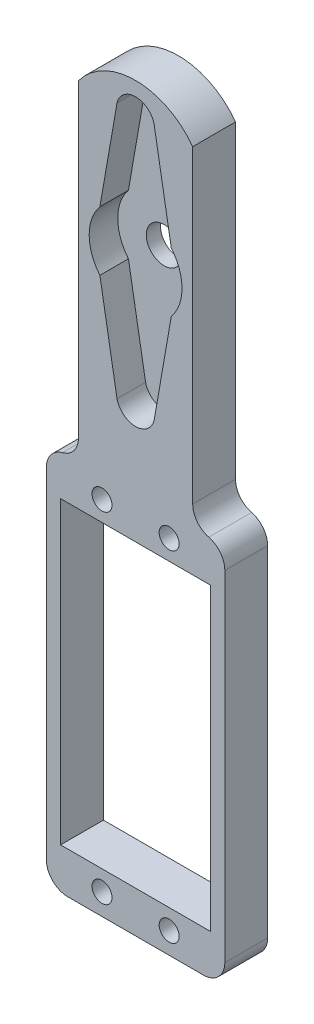
ISO-10303-21;
HEADER;
FILE_DESCRIPTION(('STEP AP214'),'2;1');
FILE_NAME('part.step','',(''),(''),'','','');
FILE_SCHEMA(('AUTOMOTIVE_DESIGN { 1 0 10303 214 1 1 1 1 }'));
ENDSEC;
DATA;
#1=APPLICATION_CONTEXT('core data for automotive mechanical design processes');
#2=APPLICATION_PROTOCOL_DEFINITION('international standard','automotive_design',2000,#1);
#3=PRODUCT_CONTEXT('',#1,'mechanical');
#4=PRODUCT('Part','Part','',(#3));
#5=PRODUCT_RELATED_PRODUCT_CATEGORY('part','',(#4));
#6=PRODUCT_DEFINITION_FORMATION('','',#4);
#7=PRODUCT_DEFINITION_CONTEXT('part definition',#1,'design');
#8=PRODUCT_DEFINITION('design','',#6,#7);
#9=PRODUCT_DEFINITION_SHAPE('','',#8);
#10=(LENGTH_UNIT() NAMED_UNIT(*) SI_UNIT(.MILLI.,.METRE.));
#11=(NAMED_UNIT(*) PLANE_ANGLE_UNIT() SI_UNIT($,.RADIAN.));
#12=(NAMED_UNIT(*) SI_UNIT($,.STERADIAN.) SOLID_ANGLE_UNIT());
#13=UNCERTAINTY_MEASURE_WITH_UNIT(LENGTH_MEASURE(1.E-05),#10,'distance_accuracy_value','');
#14=(GEOMETRIC_REPRESENTATION_CONTEXT(3) GLOBAL_UNCERTAINTY_ASSIGNED_CONTEXT((#13)) GLOBAL_UNIT_ASSIGNED_CONTEXT((#10,
#11,#12)) REPRESENTATION_CONTEXT('',''));
#15=CARTESIAN_POINT('',(0.,0.,0.));
#16=DIRECTION('',(0.,0.,1.));
#17=DIRECTION('',(1.,0.,0.));
#18=AXIS2_PLACEMENT_3D('',#15,#16,#17);
#19=CARTESIAN_POINT('',(0.,17.3284045022662,6.));
#20=DIRECTION('',(0.,0.,-1.));
#21=DIRECTION('',(-1.,0.,0.));
#22=AXIS2_PLACEMENT_3D('',#19,#20,#21);
#23=CYLINDRICAL_SURFACE('',#22,2.67159549773375);
#24=CARTESIAN_POINT('',(0.,17.3284045022662,2.));
#25=DIRECTION('',(0.,0.,-1.));
#26=DIRECTION('',(-1.,0.,0.));
#27=AXIS2_PLACEMENT_3D('',#24,#25,#26);
#28=CIRCLE('',#27,2.67159549773375);
#29=CARTESIAN_POINT('',(2.6,17.9427517196533,2.));
#30=VERTEX_POINT('',#29);
#31=CARTESIAN_POINT('',(-2.6,17.9427517196533,2.));
#32=VERTEX_POINT('',#31);
#33=EDGE_CURVE('E54',#30,#32,#28,.F.);
#34=ORIENTED_EDGE('',*,*,#33,.F.);
#35=DIRECTION('',(0.,0.,-1.));
#36=VECTOR('',#35,1.);
#37=CARTESIAN_POINT('',(2.6,17.9427517196533,6.));
#38=LINE('',#37,#36);
#39=CARTESIAN_POINT('',(2.6,17.9427517196533,6.));
#40=VERTEX_POINT('',#39);
#41=EDGE_CURVE('E340',#40,#30,#38,.T.);
#42=ORIENTED_EDGE('',*,*,#41,.F.);
#43=CARTESIAN_POINT('',(0.,17.3284045022662,6.));
#44=DIRECTION('',(0.,0.,1.));
#45=DIRECTION('',(1.,0.,0.));
#46=AXIS2_PLACEMENT_3D('',#43,#44,#45);
#47=CIRCLE('',#46,2.67159549773375);
#48=CARTESIAN_POINT('',(-2.6,17.9427517196533,6.));
#49=VERTEX_POINT('',#48);
#50=EDGE_CURVE('E233',#49,#40,#47,.F.);
#51=ORIENTED_EDGE('',*,*,#50,.F.);
#52=DIRECTION('',(0.,0.,-1.));
#53=VECTOR('',#52,1.);
#54=CARTESIAN_POINT('',(-2.6,17.9427517196533,6.));
#55=LINE('',#54,#53);
#56=EDGE_CURVE('E211',#49,#32,#55,.T.);
#57=ORIENTED_EDGE('',*,*,#56,.T.);
#58=EDGE_LOOP('',(#34,#42,#51,#57));
#59=FACE_BOUND('',#58,.T.);
#60=ADVANCED_FACE('F39',(#59),#23,.F.);
#61=CARTESIAN_POINT('',(5.55395819963136,0.96641337059102,6.));
#62=DIRECTION('',(0.985196551403809,0.171428571428571,0.));
#63=DIRECTION('',(-0.171428571428571,0.98519655140381,0.));
#64=AXIS2_PLACEMENT_3D('',#61,#62,#63);
#65=PLANE('',#64);
#66=DIRECTION('',(-0.171428571428571,0.98519655140381,0.));
#67=VECTOR('',#66,1.);
#68=CARTESIAN_POINT('',(5.55395819963136,0.96641337059102,2.));
#69=LINE('',#68,#67);
#70=CARTESIAN_POINT('',(4.99927103536296,4.15418934510465,2.));
#71=VERTEX_POINT('',#70);
#72=EDGE_CURVE('E61',#71,#30,#69,.T.);
#73=ORIENTED_EDGE('',*,*,#72,.F.);
#74=DIRECTION('',(0.,0.,-1.));
#75=VECTOR('',#74,1.);
#76=CARTESIAN_POINT('',(4.99927103536296,4.15418934510465,6.));
#77=LINE('',#76,#75);
#78=CARTESIAN_POINT('',(4.99927103536296,4.15418934510465,6.));
#79=VERTEX_POINT('',#78);
#80=EDGE_CURVE('E353',#79,#71,#77,.T.);
#81=ORIENTED_EDGE('',*,*,#80,.F.);
#82=DIRECTION('',(0.171428571428571,-0.98519655140381,0.));
#83=VECTOR('',#82,1.);
#84=CARTESIAN_POINT('',(5.55395819963136,0.96641337059102,6.));
#85=LINE('',#84,#83);
#86=EDGE_CURVE('E236',#40,#79,#85,.T.);
#87=ORIENTED_EDGE('',*,*,#86,.F.);
#88=ORIENTED_EDGE('',*,*,#41,.T.);
#89=EDGE_LOOP('',(#73,#81,#87,#88));
#90=FACE_BOUND('',#89,.T.);
#91=ADVANCED_FACE('F475',(#90),#65,.F.);
#92=CARTESIAN_POINT('',(0.,0.,6.));
#93=DIRECTION('',(0.,0.,-1.));
#94=DIRECTION('',(-1.,0.,0.));
#95=AXIS2_PLACEMENT_3D('',#92,#93,#94);
#96=CYLINDRICAL_SURFACE('',#95,6.5);
#97=ORIENTED_EDGE('',*,*,#80,.T.);
#98=CARTESIAN_POINT('',(0.,0.,2.));
#99=DIRECTION('',(0.,0.,-1.));
#100=DIRECTION('',(-1.,0.,0.));
#101=AXIS2_PLACEMENT_3D('',#98,#99,#100);
#102=CIRCLE('',#101,6.5);
#103=CARTESIAN_POINT('',(4.99927103536296,-4.15418934510465,2.));
#104=VERTEX_POINT('',#103);
#105=EDGE_CURVE('E229',#71,#104,#102,.T.);
#106=ORIENTED_EDGE('',*,*,#105,.T.);
#107=DIRECTION('',(0.,0.,-1.));
#108=VECTOR('',#107,1.);
#109=CARTESIAN_POINT('',(4.99927103536296,-4.15418934510465,6.));
#110=LINE('',#109,#108);
#111=CARTESIAN_POINT('',(4.99927103536296,-4.15418934510465,6.));
#112=VERTEX_POINT('',#111);
#113=EDGE_CURVE('E350',#112,#104,#110,.T.);
#114=ORIENTED_EDGE('',*,*,#113,.F.);
#115=CARTESIAN_POINT('',(0.,0.,6.));
#116=DIRECTION('',(0.,0.,1.));
#117=DIRECTION('',(1.,0.,0.));
#118=AXIS2_PLACEMENT_3D('',#115,#116,#117);
#119=CIRCLE('',#118,6.5);
#120=EDGE_CURVE('E239',#112,#79,#119,.T.);
#121=ORIENTED_EDGE('',*,*,#120,.T.);
#122=EDGE_LOOP('',(#97,#106,#114,#121));
#123=FACE_BOUND('',#122,.T.);
#124=ADVANCED_FACE('F480',(#123),#96,.F.);
#125=CARTESIAN_POINT('',(5.55395819963136,-0.96641337059102,6.));
#126=DIRECTION('',(-0.985196551403809,0.171428571428571,0.));
#127=DIRECTION('',(-0.171428571428571,-0.98519655140381,0.));
#128=AXIS2_PLACEMENT_3D('',#125,#126,#127);
#129=PLANE('',#128);
#130=ORIENTED_EDGE('',*,*,#113,.T.);
#131=DIRECTION('',(-0.171428571428571,-0.98519655140381,0.));
#132=VECTOR('',#131,1.);
#133=CARTESIAN_POINT('',(5.55395819963136,-0.96641337059102,2.));
#134=LINE('',#133,#132);
#135=CARTESIAN_POINT('',(2.6,-17.9427517196533,2.));
#136=VERTEX_POINT('',#135);
#137=EDGE_CURVE('E753',#104,#136,#134,.T.);
#138=ORIENTED_EDGE('',*,*,#137,.T.);
#139=DIRECTION('',(0.,0.,-1.));
#140=VECTOR('',#139,1.);
#141=CARTESIAN_POINT('',(2.6,-17.9427517196533,6.));
#142=LINE('',#141,#140);
#143=CARTESIAN_POINT('',(2.6,-17.9427517196533,6.));
#144=VERTEX_POINT('',#143);
#145=EDGE_CURVE('E347',#144,#136,#142,.T.);
#146=ORIENTED_EDGE('',*,*,#145,.F.);
#147=DIRECTION('',(0.171428571428571,0.98519655140381,0.));
#148=VECTOR('',#147,1.);
#149=CARTESIAN_POINT('',(5.55395819963136,-0.96641337059102,6.));
#150=LINE('',#149,#148);
#151=EDGE_CURVE('E242',#144,#112,#150,.T.);
#152=ORIENTED_EDGE('',*,*,#151,.T.);
#153=EDGE_LOOP('',(#130,#138,#146,#152));
#154=FACE_BOUND('',#153,.T.);
#155=ADVANCED_FACE('F661',(#154),#129,.T.);
#156=CARTESIAN_POINT('',(0.,-17.3284045022662,6.));
#157=DIRECTION('',(0.,0.,-1.));
#158=DIRECTION('',(-1.,0.,0.));
#159=AXIS2_PLACEMENT_3D('',#156,#157,#158);
#160=CYLINDRICAL_SURFACE('',#159,2.67159549773375);
#161=ORIENTED_EDGE('',*,*,#145,.T.);
#162=CARTESIAN_POINT('',(0.,-17.3284045022662,2.));
#163=DIRECTION('',(0.,0.,-1.));
#164=DIRECTION('',(-1.,0.,0.));
#165=AXIS2_PLACEMENT_3D('',#162,#163,#164);
#166=CIRCLE('',#165,2.67159549773375);
#167=CARTESIAN_POINT('',(-2.6,-17.9427517196533,2.));
#168=VERTEX_POINT('',#167);
#169=EDGE_CURVE('E754',#136,#168,#166,.T.);
#170=ORIENTED_EDGE('',*,*,#169,.T.);
#171=DIRECTION('',(0.,0.,-1.));
#172=VECTOR('',#171,1.);
#173=CARTESIAN_POINT('',(-2.6,-17.9427517196533,6.));
#174=LINE('',#173,#172);
#175=CARTESIAN_POINT('',(-2.6,-17.9427517196533,6.));
#176=VERTEX_POINT('',#175);
#177=EDGE_CURVE('E344',#176,#168,#174,.T.);
#178=ORIENTED_EDGE('',*,*,#177,.F.);
#179=CARTESIAN_POINT('',(0.,-17.3284045022662,6.));
#180=DIRECTION('',(0.,0.,1.));
#181=DIRECTION('',(1.,0.,0.));
#182=AXIS2_PLACEMENT_3D('',#179,#180,#181);
#183=CIRCLE('',#182,2.67159549773375);
#184=EDGE_CURVE('E245',#176,#144,#183,.T.);
#185=ORIENTED_EDGE('',*,*,#184,.T.);
#186=EDGE_LOOP('',(#161,#170,#178,#185));
#187=FACE_BOUND('',#186,.T.);
#188=ADVANCED_FACE('F653',(#187),#160,.F.);
#189=CARTESIAN_POINT('',(-5.55395819963136,-0.96641337059102,6.));
#190=DIRECTION('',(0.985196551403809,0.171428571428571,0.));
#191=DIRECTION('',(-0.171428571428571,0.98519655140381,0.));
#192=AXIS2_PLACEMENT_3D('',#189,#190,#191);
#193=PLANE('',#192);
#194=ORIENTED_EDGE('',*,*,#177,.T.);
#195=DIRECTION('',(-0.171428571428571,0.98519655140381,0.));
#196=VECTOR('',#195,1.);
#197=CARTESIAN_POINT('',(-5.55395819963136,-0.96641337059102,2.));
#198=LINE('',#197,#196);
#199=CARTESIAN_POINT('',(-4.99927103536296,-4.15418934510465,2.));
#200=VERTEX_POINT('',#199);
#201=EDGE_CURVE('E219',#168,#200,#198,.T.);
#202=ORIENTED_EDGE('',*,*,#201,.T.);
#203=DIRECTION('',(0.,0.,-1.));
#204=VECTOR('',#203,1.);
#205=CARTESIAN_POINT('',(-4.99927103536296,-4.15418934510465,6.));
#206=LINE('',#205,#204);
#207=CARTESIAN_POINT('',(-4.99927103536296,-4.15418934510465,6.));
#208=VERTEX_POINT('',#207);
#209=EDGE_CURVE('E210',#208,#200,#206,.T.);
#210=ORIENTED_EDGE('',*,*,#209,.F.);
#211=DIRECTION('',(0.171428571428571,-0.98519655140381,0.));
#212=VECTOR('',#211,1.);
#213=CARTESIAN_POINT('',(-5.55395819963136,-0.96641337059102,6.));
#214=LINE('',#213,#212);
#215=EDGE_CURVE('E248',#208,#176,#214,.T.);
#216=ORIENTED_EDGE('',*,*,#215,.T.);
#217=EDGE_LOOP('',(#194,#202,#210,#216));
#218=FACE_BOUND('',#217,.T.);
#219=ADVANCED_FACE('F646',(#218),#193,.T.);
#220=CARTESIAN_POINT('',(0.,0.,6.));
#221=DIRECTION('',(0.,0.,-1.));
#222=DIRECTION('',(-1.,0.,0.));
#223=AXIS2_PLACEMENT_3D('',#220,#221,#222);
#224=CYLINDRICAL_SURFACE('',#223,6.5);
#225=ORIENTED_EDGE('',*,*,#209,.T.);
#226=CARTESIAN_POINT('',(0.,0.,2.));
#227=DIRECTION('',(0.,0.,-1.));
#228=DIRECTION('',(-1.,0.,0.));
#229=AXIS2_PLACEMENT_3D('',#226,#227,#228);
#230=CIRCLE('',#229,6.5);
#231=CARTESIAN_POINT('',(-4.99927103536296,4.15418934510465,2.));
#232=VERTEX_POINT('',#231);
#233=EDGE_CURVE('E215',#200,#232,#230,.T.);
#234=ORIENTED_EDGE('',*,*,#233,.T.);
#235=DIRECTION('',(0.,0.,-1.));
#236=VECTOR('',#235,1.);
#237=CARTESIAN_POINT('',(-4.99927103536296,4.15418934510465,6.));
#238=LINE('',#237,#236);
#239=CARTESIAN_POINT('',(-4.99927103536296,4.15418934510465,6.));
#240=VERTEX_POINT('',#239);
#241=EDGE_CURVE('E202',#240,#232,#238,.T.);
#242=ORIENTED_EDGE('',*,*,#241,.F.);
#243=CARTESIAN_POINT('',(0.,0.,6.));
#244=DIRECTION('',(0.,0.,1.));
#245=DIRECTION('',(1.,0.,0.));
#246=AXIS2_PLACEMENT_3D('',#243,#244,#245);
#247=CIRCLE('',#246,6.5);
#248=EDGE_CURVE('E251',#240,#208,#247,.T.);
#249=ORIENTED_EDGE('',*,*,#248,.T.);
#250=EDGE_LOOP('',(#225,#234,#242,#249));
#251=FACE_BOUND('',#250,.T.);
#252=ADVANCED_FACE('F216',(#251),#224,.F.);
#253=CARTESIAN_POINT('',(-5.55395819963136,0.96641337059102,6.));
#254=DIRECTION('',(-0.985196551403809,0.171428571428571,0.));
#255=DIRECTION('',(-0.171428571428571,-0.98519655140381,0.));
#256=AXIS2_PLACEMENT_3D('',#253,#254,#255);
#257=PLANE('',#256);
#258=DIRECTION('',(-0.171428571428571,-0.98519655140381,0.));
#259=VECTOR('',#258,1.);
#260=CARTESIAN_POINT('',(-5.55395819963136,0.96641337059102,2.));
#261=LINE('',#260,#259);
#262=EDGE_CURVE('E11',#32,#232,#261,.T.);
#263=ORIENTED_EDGE('',*,*,#262,.F.);
#264=ORIENTED_EDGE('',*,*,#56,.F.);
#265=DIRECTION('',(0.171428571428571,0.98519655140381,0.));
#266=VECTOR('',#265,1.);
#267=CARTESIAN_POINT('',(-5.55395819963136,0.96641337059102,6.));
#268=LINE('',#267,#266);
#269=EDGE_CURVE('E206',#240,#49,#268,.T.);
#270=ORIENTED_EDGE('',*,*,#269,.F.);
#271=ORIENTED_EDGE('',*,*,#241,.T.);
#272=EDGE_LOOP('',(#263,#264,#270,#271));
#273=FACE_BOUND('',#272,.T.);
#274=ADVANCED_FACE('F204',(#273),#257,.F.);
#275=CARTESIAN_POINT('',(0.,-34.,6.));
#276=DIRECTION('',(0.,1.,0.));
#277=DIRECTION('',(0.,0.,1.));
#278=AXIS2_PLACEMENT_3D('',#275,#276,#277);
#279=PLANE('',#278);
#280=DIRECTION('',(1.,0.,0.));
#281=VECTOR('',#280,1.);
#282=CARTESIAN_POINT('',(0.,-34.,0.));
#283=LINE('',#282,#281);
#284=CARTESIAN_POINT('',(-10.5,-34.,0.));
#285=VERTEX_POINT('',#284);
#286=CARTESIAN_POINT('',(10.5,-34.,0.));
#287=VERTEX_POINT('',#286);
#288=EDGE_CURVE('E312',#285,#287,#283,.T.);
#289=ORIENTED_EDGE('',*,*,#288,.T.);
#290=DIRECTION('',(0.,0.,-1.));
#291=VECTOR('',#290,1.);
#292=CARTESIAN_POINT('',(10.5,-34.,6.));
#293=LINE('',#292,#291);
#294=CARTESIAN_POINT('',(10.5,-34.,6.));
#295=VERTEX_POINT('',#294);
#296=EDGE_CURVE('E333',#295,#287,#293,.T.);
#297=ORIENTED_EDGE('',*,*,#296,.F.);
#298=DIRECTION('',(1.,0.,0.));
#299=VECTOR('',#298,1.);
#300=CARTESIAN_POINT('',(0.,-34.,6.));
#301=LINE('',#300,#299);
#302=CARTESIAN_POINT('',(-10.5,-34.,6.));
#303=VERTEX_POINT('',#302);
#304=EDGE_CURVE('E278',#303,#295,#301,.T.);
#305=ORIENTED_EDGE('',*,*,#304,.F.);
#306=DIRECTION('',(0.,0.,-1.));
#307=VECTOR('',#306,1.);
#308=CARTESIAN_POINT('',(-10.5,-34.,6.));
#309=LINE('',#308,#307);
#310=EDGE_CURVE('E326',#303,#285,#309,.T.);
#311=ORIENTED_EDGE('',*,*,#310,.T.);
#312=EDGE_LOOP('',(#289,#297,#305,#311));
#313=FACE_BOUND('',#312,.T.);
#314=ADVANCED_FACE('F530',(#313),#279,.F.);
#315=CARTESIAN_POINT('',(10.5,0.,6.));
#316=DIRECTION('',(1.,0.,0.));
#317=DIRECTION('',(0.,1.,0.));
#318=AXIS2_PLACEMENT_3D('',#315,#316,#317);
#319=PLANE('',#318);
#320=DIRECTION('',(0.,-1.,0.));
#321=VECTOR('',#320,1.);
#322=CARTESIAN_POINT('',(10.5,0.,0.));
#323=LINE('',#322,#321);
#324=CARTESIAN_POINT('',(10.5,-76.,0.));
#325=VERTEX_POINT('',#324);
#326=EDGE_CURVE('E315',#287,#325,#323,.T.);
#327=ORIENTED_EDGE('',*,*,#326,.T.);
#328=DIRECTION('',(0.,0.,-1.));
#329=VECTOR('',#328,1.);
#330=CARTESIAN_POINT('',(10.5,-76.,6.));
#331=LINE('',#330,#329);
#332=CARTESIAN_POINT('',(10.5,-76.,6.));
#333=VERTEX_POINT('',#332);
#334=EDGE_CURVE('E331',#333,#325,#331,.T.);
#335=ORIENTED_EDGE('',*,*,#334,.F.);
#336=DIRECTION('',(0.,-1.,0.));
#337=VECTOR('',#336,1.);
#338=CARTESIAN_POINT('',(10.5,0.,6.));
#339=LINE('',#338,#337);
#340=EDGE_CURVE('E281',#295,#333,#339,.T.);
#341=ORIENTED_EDGE('',*,*,#340,.F.);
#342=ORIENTED_EDGE('',*,*,#296,.T.);
#343=EDGE_LOOP('',(#327,#335,#341,#342));
#344=FACE_BOUND('',#343,.T.);
#345=ADVANCED_FACE('F526',(#344),#319,.F.);
#346=CARTESIAN_POINT('',(0.,-76.,6.));
#347=DIRECTION('',(0.,1.,0.));
#348=DIRECTION('',(0.,0.,1.));
#349=AXIS2_PLACEMENT_3D('',#346,#347,#348);
#350=PLANE('',#349);
#351=DIRECTION('',(1.,0.,0.));
#352=VECTOR('',#351,1.);
#353=CARTESIAN_POINT('',(0.,-76.,0.));
#354=LINE('',#353,#352);
#355=CARTESIAN_POINT('',(-10.5,-76.,0.));
#356=VERTEX_POINT('',#355);
#357=EDGE_CURVE('E318',#356,#325,#354,.T.);
#358=ORIENTED_EDGE('',*,*,#357,.F.);
#359=DIRECTION('',(0.,0.,-1.));
#360=VECTOR('',#359,1.);
#361=CARTESIAN_POINT('',(-10.5,-76.,6.));
#362=LINE('',#361,#360);
#363=CARTESIAN_POINT('',(-10.5,-76.,6.));
#364=VERTEX_POINT('',#363);
#365=EDGE_CURVE('E328',#364,#356,#362,.T.);
#366=ORIENTED_EDGE('',*,*,#365,.F.);
#367=DIRECTION('',(1.,0.,0.));
#368=VECTOR('',#367,1.);
#369=CARTESIAN_POINT('',(0.,-76.,6.));
#370=LINE('',#369,#368);
#371=EDGE_CURVE('E283',#364,#333,#370,.T.);
#372=ORIENTED_EDGE('',*,*,#371,.T.);
#373=ORIENTED_EDGE('',*,*,#334,.T.);
#374=EDGE_LOOP('',(#358,#366,#372,#373));
#375=FACE_BOUND('',#374,.T.);
#376=ADVANCED_FACE('F523',(#375),#350,.T.);
#377=CARTESIAN_POINT('',(0.,12.0480585307482,6.));
#378=DIRECTION('',(0.,0.,-1.));
#379=DIRECTION('',(-1.,0.,0.));
#380=AXIS2_PLACEMENT_3D('',#377,#378,#379);
#381=CYLINDRICAL_SURFACE('',#380,9.93717302814665);
#382=CARTESIAN_POINT('',(0.,12.0480585307482,0.));
#383=DIRECTION('',(0.,0.,1.));
#384=DIRECTION('',(1.,0.,0.));
#385=AXIS2_PLACEMENT_3D('',#382,#383,#384);
#386=CIRCLE('',#385,9.93717302814665);
#387=CARTESIAN_POINT('',(-8.,17.9427517196533,0.));
#388=VERTEX_POINT('',#387);
#389=CARTESIAN_POINT('',(8.,17.9427517196533,0.));
#390=VERTEX_POINT('',#389);
#391=EDGE_CURVE('E224',#388,#390,#386,.F.);
#392=ORIENTED_EDGE('',*,*,#391,.F.);
#393=DIRECTION('',(0.,0.,-1.));
#394=VECTOR('',#393,1.);
#395=CARTESIAN_POINT('',(-8.,17.9427517196533,6.));
#396=LINE('',#395,#394);
#397=CARTESIAN_POINT('',(-8.,17.9427517196533,6.));
#398=VERTEX_POINT('',#397);
#399=EDGE_CURVE('E329',#398,#388,#396,.T.);
#400=ORIENTED_EDGE('',*,*,#399,.F.);
#401=CARTESIAN_POINT('',(0.,12.0480585307482,6.));
#402=DIRECTION('',(0.,0.,1.));
#403=DIRECTION('',(1.,0.,0.));
#404=AXIS2_PLACEMENT_3D('',#401,#402,#403);
#405=CIRCLE('',#404,9.93717302814665);
#406=CARTESIAN_POINT('',(8.,17.9427517196533,6.));
#407=VERTEX_POINT('',#406);
#408=EDGE_CURVE('E254',#398,#407,#405,.F.);
#409=ORIENTED_EDGE('',*,*,#408,.T.);
#410=DIRECTION('',(0.,0.,-1.));
#411=VECTOR('',#410,1.);
#412=CARTESIAN_POINT('',(8.,17.9427517196533,6.));
#413=LINE('',#412,#411);
#414=EDGE_CURVE('E337',#407,#390,#413,.T.);
#415=ORIENTED_EDGE('',*,*,#414,.T.);
#416=EDGE_LOOP('',(#392,#400,#409,#415));
#417=FACE_BOUND('',#416,.T.);
#418=ADVANCED_FACE('F429',(#417),#381,.T.);
#419=CARTESIAN_POINT('',(-8.,0.,6.));
#420=DIRECTION('',(1.,0.,0.));
#421=DIRECTION('',(0.,0.,-1.));
#422=AXIS2_PLACEMENT_3D('',#419,#420,#421);
#423=PLANE('',#422);
#424=DIRECTION('',(0.,-1.,0.));
#425=VECTOR('',#424,1.);
#426=CARTESIAN_POINT('',(-8.,0.,0.));
#427=LINE('',#426,#425);
#428=CARTESIAN_POINT('',(-8.,-25.3971774398678,0.));
#429=VERTEX_POINT('',#428);
#430=EDGE_CURVE('E227',#388,#429,#427,.T.);
#431=ORIENTED_EDGE('',*,*,#430,.T.);
#432=DIRECTION('',(0.,0.,1.));
#433=VECTOR('',#432,1.);
#434=CARTESIAN_POINT('',(-8.,-25.3971774398678,6.));
#435=LINE('',#434,#433);
#436=CARTESIAN_POINT('',(-8.,-25.3971774398678,6.));
#437=VERTEX_POINT('',#436);
#438=EDGE_CURVE('E403',#429,#437,#435,.T.);
#439=ORIENTED_EDGE('',*,*,#438,.T.);
#440=DIRECTION('',(0.,-1.,0.));
#441=VECTOR('',#440,1.);
#442=CARTESIAN_POINT('',(-8.,0.,6.));
#443=LINE('',#442,#441);
#444=EDGE_CURVE('E257',#398,#437,#443,.T.);
#445=ORIENTED_EDGE('',*,*,#444,.F.);
#446=ORIENTED_EDGE('',*,*,#399,.T.);
#447=EDGE_LOOP('',(#431,#439,#445,#446));
#448=FACE_BOUND('',#447,.T.);
#449=ADVANCED_FACE('F427',(#448),#423,.F.);
#450=CARTESIAN_POINT('',(-12.5,0.,6.));
#451=DIRECTION('',(1.,0.,0.));
#452=DIRECTION('',(0.,1.,0.));
#453=AXIS2_PLACEMENT_3D('',#450,#451,#452);
#454=PLANE('',#453);
#455=DIRECTION('',(0.,-1.,0.));
#456=VECTOR('',#455,1.);
#457=CARTESIAN_POINT('',(-12.5,0.,6.));
#458=LINE('',#457,#456);
#459=CARTESIAN_POINT('',(-12.5,-31.2066524591789,6.));
#460=VERTEX_POINT('',#459);
#461=CARTESIAN_POINT('',(-12.5,-78.7933475408211,6.));
#462=VERTEX_POINT('',#461);
#463=EDGE_CURVE('E260',#460,#462,#458,.T.);
#464=ORIENTED_EDGE('',*,*,#463,.F.);
#465=DIRECTION('',(0.,0.,-1.));
#466=VECTOR('',#465,1.);
#467=CARTESIAN_POINT('',(-12.5,-31.2066524591789,0.));
#468=LINE('',#467,#466);
#469=CARTESIAN_POINT('',(-12.5,-31.2066524591789,0.));
#470=VERTEX_POINT('',#469);
#471=EDGE_CURVE('E392',#460,#470,#468,.T.);
#472=ORIENTED_EDGE('',*,*,#471,.T.);
#473=DIRECTION('',(0.,-1.,0.));
#474=VECTOR('',#473,1.);
#475=CARTESIAN_POINT('',(-12.5,0.,0.));
#476=LINE('',#475,#474);
#477=CARTESIAN_POINT('',(-12.5,-78.7933475408211,0.));
#478=VERTEX_POINT('',#477);
#479=EDGE_CURVE('E294',#470,#478,#476,.T.);
#480=ORIENTED_EDGE('',*,*,#479,.T.);
#481=DIRECTION('',(0.,0.,-1.));
#482=VECTOR('',#481,1.);
#483=CARTESIAN_POINT('',(-12.5,-78.7933475408211,6.));
#484=LINE('',#483,#482);
#485=EDGE_CURVE('E361',#478,#462,#484,.F.);
#486=ORIENTED_EDGE('',*,*,#485,.T.);
#487=EDGE_LOOP('',(#464,#472,#480,#486));
#488=FACE_BOUND('',#487,.T.);
#489=ADVANCED_FACE('F465',(#488),#454,.F.);
#490=CARTESIAN_POINT('',(0.,-81.7933475408211,6.));
#491=DIRECTION('',(0.,1.,0.));
#492=DIRECTION('',(0.,0.,1.));
#493=AXIS2_PLACEMENT_3D('',#490,#491,#492);
#494=PLANE('',#493);
#495=DIRECTION('',(1.,0.,0.));
#496=VECTOR('',#495,1.);
#497=CARTESIAN_POINT('',(0.,-81.7933475408211,0.));
#498=LINE('',#497,#496);
#499=CARTESIAN_POINT('',(-9.49999999999999,-81.7933475408211,0.));
#500=VERTEX_POINT('',#499);
#501=CARTESIAN_POINT('',(9.50000000000001,-81.7933475408211,0.));
#502=VERTEX_POINT('',#501);
#503=EDGE_CURVE('E296',#500,#502,#498,.T.);
#504=ORIENTED_EDGE('',*,*,#503,.T.);
#505=DIRECTION('',(0.,0.,-1.));
#506=VECTOR('',#505,1.);
#507=CARTESIAN_POINT('',(9.50000000000001,-81.7933475408211,6.));
#508=LINE('',#507,#506);
#509=CARTESIAN_POINT('',(9.50000000000001,-81.7933475408211,6.));
#510=VERTEX_POINT('',#509);
#511=EDGE_CURVE('E371',#502,#510,#508,.F.);
#512=ORIENTED_EDGE('',*,*,#511,.T.);
#513=DIRECTION('',(1.,0.,0.));
#514=VECTOR('',#513,1.);
#515=CARTESIAN_POINT('',(0.,-81.7933475408211,6.));
#516=LINE('',#515,#514);
#517=CARTESIAN_POINT('',(-9.49999999999999,-81.7933475408211,6.));
#518=VERTEX_POINT('',#517);
#519=EDGE_CURVE('E262',#518,#510,#516,.T.);
#520=ORIENTED_EDGE('',*,*,#519,.F.);
#521=DIRECTION('',(0.,0.,-1.));
#522=VECTOR('',#521,1.);
#523=CARTESIAN_POINT('',(-9.49999999999999,-81.7933475408211,6.));
#524=LINE('',#523,#522);
#525=EDGE_CURVE('E336',#518,#500,#524,.T.);
#526=ORIENTED_EDGE('',*,*,#525,.T.);
#527=EDGE_LOOP('',(#504,#512,#520,#526));
#528=FACE_BOUND('',#527,.T.);
#529=ADVANCED_FACE('F458',(#528),#494,.F.);
#530=CARTESIAN_POINT('',(12.5,0.,6.));
#531=DIRECTION('',(1.,0.,0.));
#532=DIRECTION('',(0.,0.,-1.));
#533=AXIS2_PLACEMENT_3D('',#530,#531,#532);
#534=PLANE('',#533);
#535=DIRECTION('',(0.,-1.,0.));
#536=VECTOR('',#535,1.);
#537=CARTESIAN_POINT('',(12.5,0.,0.));
#538=LINE('',#537,#536);
#539=CARTESIAN_POINT('',(12.5,-31.2066524591789,0.));
#540=VERTEX_POINT('',#539);
#541=CARTESIAN_POINT('',(12.5,-78.7933475408211,0.));
#542=VERTEX_POINT('',#541);
#543=EDGE_CURVE('E299',#540,#542,#538,.T.);
#544=ORIENTED_EDGE('',*,*,#543,.F.);
#545=DIRECTION('',(0.,0.,-1.));
#546=VECTOR('',#545,1.);
#547=CARTESIAN_POINT('',(12.5,-31.2066524591789,6.));
#548=LINE('',#547,#546);
#549=CARTESIAN_POINT('',(12.5,-31.2066524591789,6.));
#550=VERTEX_POINT('',#549);
#551=EDGE_CURVE('E378',#540,#550,#548,.F.);
#552=ORIENTED_EDGE('',*,*,#551,.T.);
#553=DIRECTION('',(0.,-1.,0.));
#554=VECTOR('',#553,1.);
#555=CARTESIAN_POINT('',(12.5,0.,6.));
#556=LINE('',#555,#554);
#557=CARTESIAN_POINT('',(12.5,-78.7933475408211,6.));
#558=VERTEX_POINT('',#557);
#559=EDGE_CURVE('E265',#550,#558,#556,.T.);
#560=ORIENTED_EDGE('',*,*,#559,.T.);
#561=DIRECTION('',(0.,0.,-1.));
#562=VECTOR('',#561,1.);
#563=CARTESIAN_POINT('',(12.5,-78.7933475408211,0.));
#564=LINE('',#563,#562);
#565=EDGE_CURVE('E366',#558,#542,#564,.T.);
#566=ORIENTED_EDGE('',*,*,#565,.T.);
#567=EDGE_LOOP('',(#544,#552,#560,#566));
#568=FACE_BOUND('',#567,.T.);
#569=ADVANCED_FACE('F450',(#568),#534,.T.);
#570=CARTESIAN_POINT('',(-10.5,0.,6.));
#571=DIRECTION('',(1.,0.,0.));
#572=DIRECTION('',(0.,1.,0.));
#573=AXIS2_PLACEMENT_3D('',#570,#571,#572);
#574=PLANE('',#573);
#575=DIRECTION('',(0.,-1.,0.));
#576=VECTOR('',#575,1.);
#577=CARTESIAN_POINT('',(-10.5,0.,0.));
#578=LINE('',#577,#576);
#579=EDGE_CURVE('E321',#285,#356,#578,.T.);
#580=ORIENTED_EDGE('',*,*,#579,.F.);
#581=ORIENTED_EDGE('',*,*,#310,.F.);
#582=DIRECTION('',(0.,-1.,0.));
#583=VECTOR('',#582,1.);
#584=CARTESIAN_POINT('',(-10.5,0.,6.));
#585=LINE('',#584,#583);
#586=EDGE_CURVE('E286',#303,#364,#585,.T.);
#587=ORIENTED_EDGE('',*,*,#586,.T.);
#588=ORIENTED_EDGE('',*,*,#365,.T.);
#589=EDGE_LOOP('',(#580,#581,#587,#588));
#590=FACE_BOUND('',#589,.T.);
#591=ADVANCED_FACE('F518',(#590),#574,.T.);
#592=CARTESIAN_POINT('',(-4.7,-31.2,6.));
#593=DIRECTION('',(0.,0.,-1.));
#594=DIRECTION('',(-1.,0.,0.));
#595=AXIS2_PLACEMENT_3D('',#592,#593,#594);
#596=CYLINDRICAL_SURFACE('',#595,1.4);
#597=CARTESIAN_POINT('',(-4.7,-31.2,6.));
#598=DIRECTION('',(0.,0.,1.));
#599=DIRECTION('',(1.,0.,0.));
#600=AXIS2_PLACEMENT_3D('',#597,#598,#599);
#601=CIRCLE('',#600,1.4);
#602=CARTESIAN_POINT('',(-3.3,-31.2,6.));
#603=VERTEX_POINT('',#602);
#604=EDGE_CURVE('E275',#603,#603,#601,.T.);
#605=ORIENTED_EDGE('',*,*,#604,.T.);
#606=EDGE_LOOP('',(#605));
#607=FACE_BOUND('',#606,.T.);
#608=CARTESIAN_POINT('',(-4.7,-31.2,0.));
#609=DIRECTION('',(0.,0.,1.));
#610=DIRECTION('',(1.,0.,0.));
#611=AXIS2_PLACEMENT_3D('',#608,#609,#610);
#612=CIRCLE('',#611,1.4);
#613=CARTESIAN_POINT('',(-3.3,-31.2,0.));
#614=VERTEX_POINT('',#613);
#615=EDGE_CURVE('E309',#614,#614,#612,.T.);
#616=ORIENTED_EDGE('',*,*,#615,.F.);
#617=EDGE_LOOP('',(#616));
#618=FACE_BOUND('',#617,.T.);
#619=ADVANCED_FACE('F521',(#607,#618),#596,.F.);
#620=CARTESIAN_POINT('',(4.7,-31.2,6.));
#621=DIRECTION('',(0.,0.,-1.));
#622=DIRECTION('',(-1.,0.,0.));
#623=AXIS2_PLACEMENT_3D('',#620,#621,#622);
#624=CYLINDRICAL_SURFACE('',#623,1.4);
#625=CARTESIAN_POINT('',(4.7,-31.2,6.));
#626=DIRECTION('',(0.,0.,1.));
#627=DIRECTION('',(1.,0.,0.));
#628=AXIS2_PLACEMENT_3D('',#625,#626,#627);
#629=CIRCLE('',#628,1.4);
#630=CARTESIAN_POINT('',(6.1,-31.2,6.));
#631=VERTEX_POINT('',#630);
#632=EDGE_CURVE('E272',#631,#631,#629,.T.);
#633=ORIENTED_EDGE('',*,*,#632,.T.);
#634=EDGE_LOOP('',(#633));
#635=FACE_BOUND('',#634,.T.);
#636=CARTESIAN_POINT('',(4.7,-31.2,0.));
#637=DIRECTION('',(0.,0.,1.));
#638=DIRECTION('',(1.,0.,0.));
#639=AXIS2_PLACEMENT_3D('',#636,#637,#638);
#640=CIRCLE('',#639,1.4);
#641=CARTESIAN_POINT('',(6.1,-31.2,0.));
#642=VERTEX_POINT('',#641);
#643=EDGE_CURVE('E306',#642,#642,#640,.T.);
#644=ORIENTED_EDGE('',*,*,#643,.F.);
#645=EDGE_LOOP('',(#644));
#646=FACE_BOUND('',#645,.T.);
#647=ADVANCED_FACE('F537',(#635,#646),#624,.F.);
#648=CARTESIAN_POINT('',(4.7,-78.8,6.));
#649=DIRECTION('',(0.,0.,-1.));
#650=DIRECTION('',(-1.,0.,0.));
#651=AXIS2_PLACEMENT_3D('',#648,#649,#650);
#652=CYLINDRICAL_SURFACE('',#651,1.4);
#653=CARTESIAN_POINT('',(4.7,-78.8,6.));
#654=DIRECTION('',(0.,0.,1.));
#655=DIRECTION('',(1.,0.,0.));
#656=AXIS2_PLACEMENT_3D('',#653,#654,#655);
#657=CIRCLE('',#656,1.4);
#658=CARTESIAN_POINT('',(6.1,-78.8,6.));
#659=VERTEX_POINT('',#658);
#660=EDGE_CURVE('E269',#659,#659,#657,.F.);
#661=ORIENTED_EDGE('',*,*,#660,.F.);
#662=EDGE_LOOP('',(#661));
#663=FACE_BOUND('',#662,.T.);
#664=CARTESIAN_POINT('',(4.7,-78.8,0.));
#665=DIRECTION('',(0.,0.,1.));
#666=DIRECTION('',(1.,0.,0.));
#667=AXIS2_PLACEMENT_3D('',#664,#665,#666);
#668=CIRCLE('',#667,1.4);
#669=CARTESIAN_POINT('',(6.1,-78.8,0.));
#670=VERTEX_POINT('',#669);
#671=EDGE_CURVE('E303',#670,#670,#668,.F.);
#672=ORIENTED_EDGE('',*,*,#671,.T.);
#673=EDGE_LOOP('',(#672));
#674=FACE_BOUND('',#673,.T.);
#675=ADVANCED_FACE('F541',(#663,#674),#652,.F.);
#676=CARTESIAN_POINT('',(8.,0.,6.));
#677=DIRECTION('',(-1.,0.,0.));
#678=DIRECTION('',(0.,0.,1.));
#679=AXIS2_PLACEMENT_3D('',#676,#677,#678);
#680=PLANE('',#679);
#681=DIRECTION('',(0.,1.,0.));
#682=VECTOR('',#681,1.);
#683=CARTESIAN_POINT('',(8.,0.,6.));
#684=LINE('',#683,#682);
#685=CARTESIAN_POINT('',(8.,-25.3971774398678,6.));
#686=VERTEX_POINT('',#685);
#687=EDGE_CURVE('E267',#686,#407,#684,.T.);
#688=ORIENTED_EDGE('',*,*,#687,.F.);
#689=DIRECTION('',(0.,0.,-1.));
#690=VECTOR('',#689,1.);
#691=CARTESIAN_POINT('',(8.,-25.3971774398678,6.));
#692=LINE('',#691,#690);
#693=CARTESIAN_POINT('',(8.,-25.3971774398678,0.));
#694=VERTEX_POINT('',#693);
#695=EDGE_CURVE('E383',#686,#694,#692,.T.);
#696=ORIENTED_EDGE('',*,*,#695,.T.);
#697=DIRECTION('',(0.,1.,0.));
#698=VECTOR('',#697,1.);
#699=CARTESIAN_POINT('',(8.,0.,0.));
#700=LINE('',#699,#698);
#701=EDGE_CURVE('E301',#694,#390,#700,.T.);
#702=ORIENTED_EDGE('',*,*,#701,.T.);
#703=ORIENTED_EDGE('',*,*,#414,.F.);
#704=EDGE_LOOP('',(#688,#696,#702,#703));
#705=FACE_BOUND('',#704,.T.);
#706=ADVANCED_FACE('F435',(#705),#680,.F.);
#707=CARTESIAN_POINT('',(-4.7,-78.8,6.));
#708=DIRECTION('',(0.,0.,-1.));
#709=DIRECTION('',(-1.,0.,0.));
#710=AXIS2_PLACEMENT_3D('',#707,#708,#709);
#711=CYLINDRICAL_SURFACE('',#710,1.4);
#712=CARTESIAN_POINT('',(-4.7,-78.8,6.));
#713=DIRECTION('',(0.,0.,1.));
#714=DIRECTION('',(1.,0.,0.));
#715=AXIS2_PLACEMENT_3D('',#712,#713,#714);
#716=CIRCLE('',#715,1.4);
#717=CARTESIAN_POINT('',(-3.3,-78.8,6.));
#718=VERTEX_POINT('',#717);
#719=EDGE_CURVE('E289',#718,#718,#716,.F.);
#720=ORIENTED_EDGE('',*,*,#719,.F.);
#721=EDGE_LOOP('',(#720));
#722=FACE_BOUND('',#721,.T.);
#723=CARTESIAN_POINT('',(-4.7,-78.8,0.));
#724=DIRECTION('',(0.,0.,1.));
#725=DIRECTION('',(1.,0.,0.));
#726=AXIS2_PLACEMENT_3D('',#723,#724,#725);
#727=CIRCLE('',#726,1.4);
#728=CARTESIAN_POINT('',(-3.3,-78.8,0.));
#729=VERTEX_POINT('',#728);
#730=EDGE_CURVE('E237',#729,#729,#727,.F.);
#731=ORIENTED_EDGE('',*,*,#730,.T.);
#732=EDGE_LOOP('',(#731));
#733=FACE_BOUND('',#732,.T.);
#734=ADVANCED_FACE('F510',(#722,#733),#711,.F.);
#735=CARTESIAN_POINT('',(0.,0.,6.));
#736=DIRECTION('',(0.,0.,1.));
#737=DIRECTION('',(1.,0.,0.));
#738=AXIS2_PLACEMENT_3D('',#735,#736,#737);
#739=PLANE('',#738);
#740=ORIENTED_EDGE('',*,*,#50,.T.);
#741=ORIENTED_EDGE('',*,*,#86,.T.);
#742=ORIENTED_EDGE('',*,*,#120,.F.);
#743=ORIENTED_EDGE('',*,*,#151,.F.);
#744=ORIENTED_EDGE('',*,*,#184,.F.);
#745=ORIENTED_EDGE('',*,*,#215,.F.);
#746=ORIENTED_EDGE('',*,*,#248,.F.);
#747=ORIENTED_EDGE('',*,*,#269,.T.);
#748=EDGE_LOOP('',(#740,#741,#742,#743,#744,#745,#746,#747));
#749=FACE_BOUND('',#748,.T.);
#750=ORIENTED_EDGE('',*,*,#444,.T.);
#751=CARTESIAN_POINT('',(-11.,-25.3971774398678,6.));
#752=DIRECTION('',(0.,0.,1.));
#753=DIRECTION('',(1.,0.,0.));
#754=AXIS2_PLACEMENT_3D('',#751,#752,#753);
#755=CIRCLE('',#754,3.);
#756=CARTESIAN_POINT('',(-10.25,-28.3019149495234,6.));
#757=VERTEX_POINT('',#756);
#758=EDGE_CURVE('E47',#437,#757,#755,.F.);
#759=ORIENTED_EDGE('',*,*,#758,.T.);
#760=CARTESIAN_POINT('',(-9.49999999999999,-31.2066524591789,6.));
#761=DIRECTION('',(0.,0.,1.));
#762=DIRECTION('',(1.,0.,0.));
#763=AXIS2_PLACEMENT_3D('',#760,#761,#762);
#764=CIRCLE('',#763,3.);
#765=EDGE_CURVE('E398',#757,#460,#764,.T.);
#766=ORIENTED_EDGE('',*,*,#765,.T.);
#767=ORIENTED_EDGE('',*,*,#463,.T.);
#768=CARTESIAN_POINT('',(-9.49999999999999,-78.7933475408211,6.));
#769=DIRECTION('',(0.,0.,1.));
#770=DIRECTION('',(1.,0.,0.));
#771=AXIS2_PLACEMENT_3D('',#768,#769,#770);
#772=CIRCLE('',#771,3.);
#773=EDGE_CURVE('E364',#462,#518,#772,.T.);
#774=ORIENTED_EDGE('',*,*,#773,.T.);
#775=ORIENTED_EDGE('',*,*,#519,.T.);
#776=CARTESIAN_POINT('',(9.50000000000001,-78.7933475408211,6.));
#777=DIRECTION('',(0.,0.,1.));
#778=DIRECTION('',(1.,0.,0.));
#779=AXIS2_PLACEMENT_3D('',#776,#777,#778);
#780=CIRCLE('',#779,3.);
#781=EDGE_CURVE('E373',#510,#558,#780,.T.);
#782=ORIENTED_EDGE('',*,*,#781,.T.);
#783=ORIENTED_EDGE('',*,*,#559,.F.);
#784=CARTESIAN_POINT('',(9.50000000000001,-31.2066524591789,6.));
#785=DIRECTION('',(0.,0.,1.));
#786=DIRECTION('',(1.,0.,0.));
#787=AXIS2_PLACEMENT_3D('',#784,#785,#786);
#788=CIRCLE('',#787,3.);
#789=CARTESIAN_POINT('',(10.25,-28.3019149495234,6.));
#790=VERTEX_POINT('',#789);
#791=EDGE_CURVE('E380',#550,#790,#788,.T.);
#792=ORIENTED_EDGE('',*,*,#791,.T.);
#793=CARTESIAN_POINT('',(11.,-25.3971774398678,6.));
#794=DIRECTION('',(0.,0.,1.));
#795=DIRECTION('',(1.,0.,0.));
#796=AXIS2_PLACEMENT_3D('',#793,#794,#795);
#797=CIRCLE('',#796,3.);
#798=EDGE_CURVE('E390',#790,#686,#797,.F.);
#799=ORIENTED_EDGE('',*,*,#798,.T.);
#800=ORIENTED_EDGE('',*,*,#687,.T.);
#801=ORIENTED_EDGE('',*,*,#408,.F.);
#802=EDGE_LOOP('',(#750,#759,#766,#767,#774,#775,#782,#783,#792,#799,#800,#801));
#803=FACE_BOUND('',#802,.T.);
#804=ORIENTED_EDGE('',*,*,#660,.T.);
#805=EDGE_LOOP('',(#804));
#806=FACE_BOUND('',#805,.T.);
#807=ORIENTED_EDGE('',*,*,#632,.F.);
#808=EDGE_LOOP('',(#807));
#809=FACE_BOUND('',#808,.T.);
#810=ORIENTED_EDGE('',*,*,#604,.F.);
#811=EDGE_LOOP('',(#810));
#812=FACE_BOUND('',#811,.T.);
#813=ORIENTED_EDGE('',*,*,#304,.T.);
#814=ORIENTED_EDGE('',*,*,#340,.T.);
#815=ORIENTED_EDGE('',*,*,#371,.F.);
#816=ORIENTED_EDGE('',*,*,#586,.F.);
#817=EDGE_LOOP('',(#813,#814,#815,#816));
#818=FACE_BOUND('',#817,.T.);
#819=ORIENTED_EDGE('',*,*,#719,.T.);
#820=EDGE_LOOP('',(#819));
#821=FACE_BOUND('',#820,.T.);
#822=ADVANCED_FACE('F409',(#749,#803,#806,#809,#812,#818,#821),#739,.T.);
#823=CARTESIAN_POINT('',(0.,0.,0.));
#824=DIRECTION('',(0.,0.,1.));
#825=DIRECTION('',(1.,0.,0.));
#826=AXIS2_PLACEMENT_3D('',#823,#824,#825);
#827=PLANE('',#826);
#828=ORIENTED_EDGE('',*,*,#730,.F.);
#829=EDGE_LOOP('',(#828));
#830=FACE_BOUND('',#829,.T.);
#831=ORIENTED_EDGE('',*,*,#288,.F.);
#832=ORIENTED_EDGE('',*,*,#579,.T.);
#833=ORIENTED_EDGE('',*,*,#357,.T.);
#834=ORIENTED_EDGE('',*,*,#326,.F.);
#835=EDGE_LOOP('',(#831,#832,#833,#834));
#836=FACE_BOUND('',#835,.T.);
#837=ORIENTED_EDGE('',*,*,#615,.T.);
#838=EDGE_LOOP('',(#837));
#839=FACE_BOUND('',#838,.T.);
#840=ORIENTED_EDGE('',*,*,#643,.T.);
#841=EDGE_LOOP('',(#840));
#842=FACE_BOUND('',#841,.T.);
#843=ORIENTED_EDGE('',*,*,#671,.F.);
#844=EDGE_LOOP('',(#843));
#845=FACE_BOUND('',#844,.T.);
#846=ORIENTED_EDGE('',*,*,#479,.F.);
#847=CARTESIAN_POINT('',(-9.49999999999999,-31.2066524591789,0.));
#848=DIRECTION('',(0.,0.,1.));
#849=DIRECTION('',(1.,0.,0.));
#850=AXIS2_PLACEMENT_3D('',#847,#848,#849);
#851=CIRCLE('',#850,3.);
#852=CARTESIAN_POINT('',(-10.25,-28.3019149495234,0.));
#853=VERTEX_POINT('',#852);
#854=EDGE_CURVE('E395',#470,#853,#851,.F.);
#855=ORIENTED_EDGE('',*,*,#854,.T.);
#856=CARTESIAN_POINT('',(-11.,-25.3971774398678,0.));
#857=DIRECTION('',(0.,0.,1.));
#858=DIRECTION('',(1.,0.,0.));
#859=AXIS2_PLACEMENT_3D('',#856,#857,#858);
#860=CIRCLE('',#859,3.);
#861=EDGE_CURVE('E405',#853,#429,#860,.T.);
#862=ORIENTED_EDGE('',*,*,#861,.T.);
#863=ORIENTED_EDGE('',*,*,#430,.F.);
#864=ORIENTED_EDGE('',*,*,#391,.T.);
#865=ORIENTED_EDGE('',*,*,#701,.F.);
#866=CARTESIAN_POINT('',(11.,-25.3971774398678,0.));
#867=DIRECTION('',(0.,0.,1.));
#868=DIRECTION('',(1.,0.,0.));
#869=AXIS2_PLACEMENT_3D('',#866,#867,#868);
#870=CIRCLE('',#869,3.);
#871=CARTESIAN_POINT('',(10.25,-28.3019149495234,0.));
#872=VERTEX_POINT('',#871);
#873=EDGE_CURVE('E388',#694,#872,#870,.T.);
#874=ORIENTED_EDGE('',*,*,#873,.T.);
#875=CARTESIAN_POINT('',(9.50000000000001,-31.2066524591789,0.));
#876=DIRECTION('',(0.,0.,1.));
#877=DIRECTION('',(1.,0.,0.));
#878=AXIS2_PLACEMENT_3D('',#875,#876,#877);
#879=CIRCLE('',#878,3.);
#880=EDGE_CURVE('E376',#872,#540,#879,.F.);
#881=ORIENTED_EDGE('',*,*,#880,.T.);
#882=ORIENTED_EDGE('',*,*,#543,.T.);
#883=CARTESIAN_POINT('',(9.50000000000001,-78.7933475408211,0.));
#884=DIRECTION('',(0.,0.,1.));
#885=DIRECTION('',(1.,0.,0.));
#886=AXIS2_PLACEMENT_3D('',#883,#884,#885);
#887=CIRCLE('',#886,3.);
#888=EDGE_CURVE('E369',#542,#502,#887,.F.);
#889=ORIENTED_EDGE('',*,*,#888,.T.);
#890=ORIENTED_EDGE('',*,*,#503,.F.);
#891=CARTESIAN_POINT('',(-9.49999999999999,-78.7933475408211,0.));
#892=DIRECTION('',(0.,0.,1.));
#893=DIRECTION('',(1.,0.,0.));
#894=AXIS2_PLACEMENT_3D('',#891,#892,#893);
#895=CIRCLE('',#894,3.);
#896=EDGE_CURVE('E358',#500,#478,#895,.F.);
#897=ORIENTED_EDGE('',*,*,#896,.T.);
#898=EDGE_LOOP('',(#846,#855,#862,#863,#864,#865,#874,#881,#882,#889,#890,#897));
#899=FACE_BOUND('',#898,.T.);
#900=CARTESIAN_POINT('',(0.,0.,0.));
#901=DIRECTION('',(0.,0.,1.));
#902=DIRECTION('',(1.,0.,0.));
#903=AXIS2_PLACEMENT_3D('',#900,#901,#902);
#904=CIRCLE('',#903,2.5);
#905=CARTESIAN_POINT('',(2.5,0.,0.));
#906=VERTEX_POINT('',#905);
#907=EDGE_CURVE('E759',#906,#906,#904,.T.);
#908=ORIENTED_EDGE('',*,*,#907,.T.);
#909=EDGE_LOOP('',(#908));
#910=FACE_BOUND('',#909,.T.);
#911=ADVANCED_FACE('F423',(#830,#836,#839,#842,#845,#899,#910),#827,.F.);
#912=CARTESIAN_POINT('',(-9.49999999999999,-78.7933475408211,6.));
#913=DIRECTION('',(0.,0.,-1.));
#914=DIRECTION('',(-1.,0.,0.));
#915=AXIS2_PLACEMENT_3D('',#912,#913,#914);
#916=CYLINDRICAL_SURFACE('',#915,3.);
#917=ORIENTED_EDGE('',*,*,#773,.F.);
#918=ORIENTED_EDGE('',*,*,#485,.F.);
#919=ORIENTED_EDGE('',*,*,#896,.F.);
#920=ORIENTED_EDGE('',*,*,#525,.F.);
#921=EDGE_LOOP('',(#917,#918,#919,#920));
#922=FACE_BOUND('',#921,.T.);
#923=ADVANCED_FACE('F463',(#922),#916,.T.);
#924=CARTESIAN_POINT('',(9.50000000000001,-78.7933475408211,6.));
#925=DIRECTION('',(0.,0.,1.));
#926=DIRECTION('',(1.,0.,0.));
#927=AXIS2_PLACEMENT_3D('',#924,#925,#926);
#928=CYLINDRICAL_SURFACE('',#927,3.);
#929=ORIENTED_EDGE('',*,*,#781,.F.);
#930=ORIENTED_EDGE('',*,*,#511,.F.);
#931=ORIENTED_EDGE('',*,*,#888,.F.);
#932=ORIENTED_EDGE('',*,*,#565,.F.);
#933=EDGE_LOOP('',(#929,#930,#931,#932));
#934=FACE_BOUND('',#933,.T.);
#935=ADVANCED_FACE('F455',(#934),#928,.T.);
#936=CARTESIAN_POINT('',(9.50000000000001,-31.2066524591789,6.));
#937=DIRECTION('',(0.,0.,-1.));
#938=DIRECTION('',(-1.,0.,0.));
#939=AXIS2_PLACEMENT_3D('',#936,#937,#938);
#940=CYLINDRICAL_SURFACE('',#939,3.);
#941=ORIENTED_EDGE('',*,*,#880,.F.);
#942=DIRECTION('',(0.,0.,-1.));
#943=VECTOR('',#942,1.);
#944=CARTESIAN_POINT('',(10.25,-28.3019149495234,6.));
#945=LINE('',#944,#943);
#946=EDGE_CURVE('E386',#872,#790,#945,.F.);
#947=ORIENTED_EDGE('',*,*,#946,.T.);
#948=ORIENTED_EDGE('',*,*,#791,.F.);
#949=ORIENTED_EDGE('',*,*,#551,.F.);
#950=EDGE_LOOP('',(#941,#947,#948,#949));
#951=FACE_BOUND('',#950,.T.);
#952=ADVANCED_FACE('F443',(#951),#940,.T.);
#953=CARTESIAN_POINT('',(11.,-25.3971774398678,6.));
#954=DIRECTION('',(0.,0.,-1.));
#955=DIRECTION('',(-1.,0.,0.));
#956=AXIS2_PLACEMENT_3D('',#953,#954,#955);
#957=CYLINDRICAL_SURFACE('',#956,3.);
#958=ORIENTED_EDGE('',*,*,#798,.F.);
#959=ORIENTED_EDGE('',*,*,#946,.F.);
#960=ORIENTED_EDGE('',*,*,#873,.F.);
#961=ORIENTED_EDGE('',*,*,#695,.F.);
#962=EDGE_LOOP('',(#958,#959,#960,#961));
#963=FACE_BOUND('',#962,.T.);
#964=ADVANCED_FACE('F439',(#963),#957,.F.);
#965=CARTESIAN_POINT('',(-9.49999999999999,-31.2066524591789,6.));
#966=DIRECTION('',(0.,0.,1.));
#967=DIRECTION('',(1.,0.,0.));
#968=AXIS2_PLACEMENT_3D('',#965,#966,#967);
#969=CYLINDRICAL_SURFACE('',#968,3.);
#970=ORIENTED_EDGE('',*,*,#765,.F.);
#971=DIRECTION('',(0.,0.,1.));
#972=VECTOR('',#971,1.);
#973=CARTESIAN_POINT('',(-10.25,-28.3019149495234,6.));
#974=LINE('',#973,#972);
#975=EDGE_CURVE('E400',#757,#853,#974,.F.);
#976=ORIENTED_EDGE('',*,*,#975,.T.);
#977=ORIENTED_EDGE('',*,*,#854,.F.);
#978=ORIENTED_EDGE('',*,*,#471,.F.);
#979=EDGE_LOOP('',(#970,#976,#977,#978));
#980=FACE_BOUND('',#979,.T.);
#981=ADVANCED_FACE('F419',(#980),#969,.T.);
#982=CARTESIAN_POINT('',(-11.,-25.3971774398678,6.));
#983=DIRECTION('',(0.,0.,1.));
#984=DIRECTION('',(1.,0.,0.));
#985=AXIS2_PLACEMENT_3D('',#982,#983,#984);
#986=CYLINDRICAL_SURFACE('',#985,3.);
#987=ORIENTED_EDGE('',*,*,#758,.F.);
#988=ORIENTED_EDGE('',*,*,#438,.F.);
#989=ORIENTED_EDGE('',*,*,#861,.F.);
#990=ORIENTED_EDGE('',*,*,#975,.F.);
#991=EDGE_LOOP('',(#987,#988,#989,#990));
#992=FACE_BOUND('',#991,.T.);
#993=ADVANCED_FACE('F41',(#992),#986,.F.);
#994=CARTESIAN_POINT('',(-3.35878376819331,16.8425116072897,2.));
#995=DIRECTION('',(0.,0.,-1.));
#996=DIRECTION('',(-1.,0.,0.));
#997=AXIS2_PLACEMENT_3D('',#994,#995,#996);
#998=PLANE('',#997);
#999=CARTESIAN_POINT('',(0.,0.,2.));
#1000=DIRECTION('',(0.,0.,1.));
#1001=DIRECTION('',(1.,0.,0.));
#1002=AXIS2_PLACEMENT_3D('',#999,#1000,#1001);
#1003=CIRCLE('',#1002,2.5);
#1004=CARTESIAN_POINT('',(2.5,0.,2.));
#1005=VERTEX_POINT('',#1004);
#1006=EDGE_CURVE('E220',#1005,#1005,#1003,.T.);
#1007=ORIENTED_EDGE('',*,*,#1006,.F.);
#1008=EDGE_LOOP('',(#1007));
#1009=FACE_BOUND('',#1008,.T.);
#1010=ORIENTED_EDGE('',*,*,#72,.T.);
#1011=ORIENTED_EDGE('',*,*,#33,.T.);
#1012=ORIENTED_EDGE('',*,*,#262,.T.);
#1013=ORIENTED_EDGE('',*,*,#233,.F.);
#1014=ORIENTED_EDGE('',*,*,#201,.F.);
#1015=ORIENTED_EDGE('',*,*,#169,.F.);
#1016=ORIENTED_EDGE('',*,*,#137,.F.);
#1017=ORIENTED_EDGE('',*,*,#105,.F.);
#1018=EDGE_LOOP('',(#1010,#1011,#1012,#1013,#1014,#1015,#1016,#1017));
#1019=FACE_BOUND('',#1018,.T.);
#1020=ADVANCED_FACE('F222',(#1009,#1019),#998,.F.);
#1021=CARTESIAN_POINT('',(0.,0.,2.));
#1022=DIRECTION('',(0.,0.,-1.));
#1023=DIRECTION('',(-1.,0.,0.));
#1024=AXIS2_PLACEMENT_3D('',#1021,#1022,#1023);
#1025=CYLINDRICAL_SURFACE('',#1024,2.5);
#1026=ORIENTED_EDGE('',*,*,#1006,.T.);
#1027=EDGE_LOOP('',(#1026));
#1028=FACE_BOUND('',#1027,.T.);
#1029=ORIENTED_EDGE('',*,*,#907,.F.);
#1030=EDGE_LOOP('',(#1029));
#1031=FACE_BOUND('',#1030,.T.);
#1032=ADVANCED_FACE('F498',(#1028,#1031),#1025,.F.);
#1033=CLOSED_SHELL('',(#60,#91,#124,#155,#188,#219,#252,#274,#314,#345,#376,#418,#449,#489,#529,
#569,#591,#619,#647,#675,#706,#734,#822,#911,#923,#935,#952,#964,#981,#993,#1020,#1032));
#1034=MANIFOLD_SOLID_BREP('B2',#1033);
#1035=ADVANCED_BREP_SHAPE_REPRESENTATION('',(#18,#1034),#14);
#1036=SHAPE_DEFINITION_REPRESENTATION(#9,#1035);
ENDSEC;
END-ISO-10303-21;
